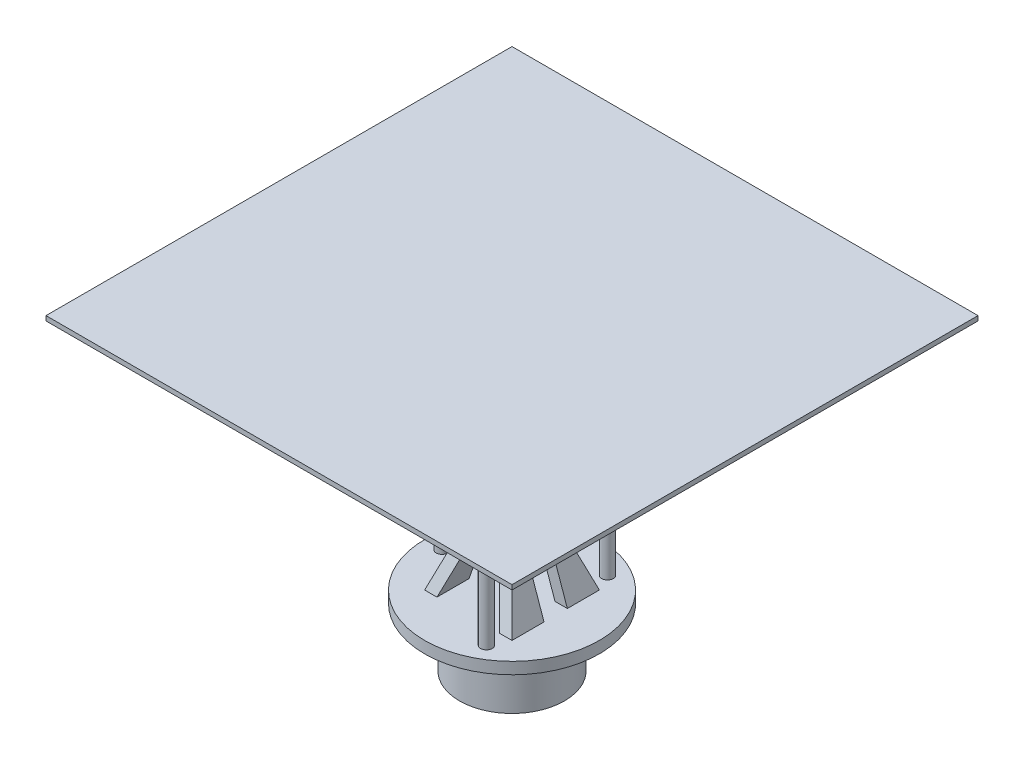
ISO-10303-21;
HEADER;
FILE_DESCRIPTION(('STEP AP214'),'2;1');
FILE_NAME('part.step','',(''),(''),'','','');
FILE_SCHEMA(('AUTOMOTIVE_DESIGN { 1 0 10303 214 1 1 1 1 }'));
ENDSEC;
DATA;
#1=APPLICATION_CONTEXT('core data for automotive mechanical design processes');
#2=APPLICATION_PROTOCOL_DEFINITION('international standard','automotive_design',2000,#1);
#3=PRODUCT_CONTEXT('',#1,'mechanical');
#4=PRODUCT('Part','Part','',(#3));
#5=PRODUCT_RELATED_PRODUCT_CATEGORY('part','',(#4));
#6=PRODUCT_DEFINITION_FORMATION('','',#4);
#7=PRODUCT_DEFINITION_CONTEXT('part definition',#1,'design');
#8=PRODUCT_DEFINITION('design','',#6,#7);
#9=PRODUCT_DEFINITION_SHAPE('','',#8);
#10=(LENGTH_UNIT() NAMED_UNIT(*) SI_UNIT(.MILLI.,.METRE.));
#11=(NAMED_UNIT(*) PLANE_ANGLE_UNIT() SI_UNIT($,.RADIAN.));
#12=(NAMED_UNIT(*) SI_UNIT($,.STERADIAN.) SOLID_ANGLE_UNIT());
#13=UNCERTAINTY_MEASURE_WITH_UNIT(LENGTH_MEASURE(1.E-05),#10,'distance_accuracy_value','');
#14=(GEOMETRIC_REPRESENTATION_CONTEXT(3) GLOBAL_UNCERTAINTY_ASSIGNED_CONTEXT((#13)) GLOBAL_UNIT_ASSIGNED_CONTEXT((#10,
#11,#12)) REPRESENTATION_CONTEXT('',''));
#15=CARTESIAN_POINT('',(0.,0.,0.));
#16=DIRECTION('',(0.,0.,1.));
#17=DIRECTION('',(1.,0.,0.));
#18=AXIS2_PLACEMENT_3D('',#15,#16,#17);
#19=CARTESIAN_POINT('',(103.,9.99999999999999,-10.));
#20=DIRECTION('',(0.,0.,1.));
#21=DIRECTION('',(1.,0.,0.));
#22=AXIS2_PLACEMENT_3D('',#19,#20,#21);
#23=PLANE('',#22);
#24=CARTESIAN_POINT('',(0.,55.,-10.));
#25=DIRECTION('',(0.,0.,1.));
#26=DIRECTION('',(1.,0.,0.));
#27=AXIS2_PLACEMENT_3D('',#24,#25,#26);
#28=CIRCLE('',#27,15.);
#29=CARTESIAN_POINT('',(-14.1421356237309,60.,-10.));
#30=VERTEX_POINT('',#29);
#31=CARTESIAN_POINT('',(-13.467179647447,48.3943151495556,-10.));
#32=VERTEX_POINT('',#31);
#33=EDGE_CURVE('E11',#30,#32,#28,.T.);
#34=ORIENTED_EDGE('',*,*,#33,.F.);
#35=DIRECTION('',(-1.,0.,0.));
#36=VECTOR('',#35,1.);
#37=CARTESIAN_POINT('',(103.,60.,-10.));
#38=LINE('',#37,#36);
#39=CARTESIAN_POINT('',(-20.,60.,-10.));
#40=VERTEX_POINT('',#39);
#41=EDGE_CURVE('E286',#30,#40,#38,.T.);
#42=ORIENTED_EDGE('',*,*,#41,.T.);
#43=DIRECTION('',(-0.330350424728106,-0.943858356366018,0.));
#44=VECTOR('',#43,1.);
#45=CARTESIAN_POINT('',(-20.,60.,-10.));
#46=LINE('',#45,#44);
#47=CARTESIAN_POINT('',(-37.5,9.99999999999999,-10.));
#48=VERTEX_POINT('',#47);
#49=EDGE_CURVE('E320',#40,#48,#46,.T.);
#50=ORIENTED_EDGE('',*,*,#49,.T.);
#51=DIRECTION('',(-1.,0.,0.));
#52=VECTOR('',#51,1.);
#53=CARTESIAN_POINT('',(103.,9.99999999999999,-10.));
#54=LINE('',#53,#52);
#55=CARTESIAN_POINT('',(-26.9051899497914,9.99999999999999,-10.));
#56=VERTEX_POINT('',#55);
#57=EDGE_CURVE('E289',#56,#48,#54,.T.);
#58=ORIENTED_EDGE('',*,*,#57,.F.);
#59=DIRECTION('',(0.330350424728106,0.943858356366017,0.));
#60=VECTOR('',#59,1.);
#61=CARTESIAN_POINT('',(-12.9051899497914,50.,-10.));
#62=LINE('',#61,#60);
#63=EDGE_CURVE('E309',#56,#32,#62,.T.);
#64=ORIENTED_EDGE('',*,*,#63,.T.);
#65=EDGE_LOOP('',(#34,#42,#50,#58,#64));
#66=FACE_BOUND('',#65,.T.);
#67=ADVANCED_FACE('F39',(#66),#23,.T.);
#68=CARTESIAN_POINT('',(103.,9.99999999999999,10.));
#69=DIRECTION('',(0.,0.,-1.));
#70=DIRECTION('',(-1.,0.,0.));
#71=AXIS2_PLACEMENT_3D('',#68,#69,#70);
#72=PLANE('',#71);
#73=CARTESIAN_POINT('',(0.,55.,10.));
#74=DIRECTION('',(0.,0.,-1.));
#75=DIRECTION('',(-1.,0.,0.));
#76=AXIS2_PLACEMENT_3D('',#73,#74,#75);
#77=CIRCLE('',#76,15.);
#78=CARTESIAN_POINT('',(14.1421356237309,60.,10.));
#79=VERTEX_POINT('',#78);
#80=CARTESIAN_POINT('',(13.467179647447,48.3943151495556,10.));
#81=VERTEX_POINT('',#80);
#82=EDGE_CURVE('E227',#79,#81,#77,.T.);
#83=ORIENTED_EDGE('',*,*,#82,.F.);
#84=DIRECTION('',(-1.,0.,0.));
#85=VECTOR('',#84,1.);
#86=CARTESIAN_POINT('',(103.,60.,10.));
#87=LINE('',#86,#85);
#88=CARTESIAN_POINT('',(20.,60.,9.99999999999999));
#89=VERTEX_POINT('',#88);
#90=EDGE_CURVE('E205',#89,#79,#87,.T.);
#91=ORIENTED_EDGE('',*,*,#90,.F.);
#92=DIRECTION('',(0.330350424728106,-0.943858356366018,0.));
#93=VECTOR('',#92,1.);
#94=CARTESIAN_POINT('',(20.,60.,9.99999999999999));
#95=LINE('',#94,#93);
#96=CARTESIAN_POINT('',(37.5,9.99999999999999,10.));
#97=VERTEX_POINT('',#96);
#98=EDGE_CURVE('E305',#89,#97,#95,.T.);
#99=ORIENTED_EDGE('',*,*,#98,.T.);
#100=DIRECTION('',(-1.,0.,0.));
#101=VECTOR('',#100,1.);
#102=CARTESIAN_POINT('',(103.,9.99999999999999,10.));
#103=LINE('',#102,#101);
#104=CARTESIAN_POINT('',(26.9051899497914,9.99999999999999,10.));
#105=VERTEX_POINT('',#104);
#106=EDGE_CURVE('E218',#97,#105,#103,.T.);
#107=ORIENTED_EDGE('',*,*,#106,.T.);
#108=DIRECTION('',(-0.330350424728106,0.943858356366018,0.));
#109=VECTOR('',#108,1.);
#110=CARTESIAN_POINT('',(12.9051899497914,50.,9.99999999999999));
#111=LINE('',#110,#109);
#112=EDGE_CURVE('E302',#105,#81,#111,.T.);
#113=ORIENTED_EDGE('',*,*,#112,.T.);
#114=EDGE_LOOP('',(#83,#91,#99,#107,#113));
#115=FACE_BOUND('',#114,.T.);
#116=ADVANCED_FACE('F472',(#115),#72,.T.);
#117=CARTESIAN_POINT('',(0.,60.,0.));
#118=DIRECTION('',(0.,1.,0.));
#119=DIRECTION('',(0.,0.,1.));
#120=AXIS2_PLACEMENT_3D('',#117,#118,#119);
#121=PLANE('',#120);
#122=DIRECTION('',(0.,0.,-1.));
#123=VECTOR('',#122,1.);
#124=CARTESIAN_POINT('',(-20.,60.,0.));
#125=LINE('',#124,#123);
#126=CARTESIAN_POINT('',(-20.,60.,-20.));
#127=VERTEX_POINT('',#126);
#128=EDGE_CURVE('E398',#40,#127,#125,.T.);
#129=ORIENTED_EDGE('',*,*,#128,.F.);
#130=ORIENTED_EDGE('',*,*,#41,.F.);
#131=CARTESIAN_POINT('',(14.1421356237309,60.,-10.));
#132=VERTEX_POINT('',#131);
#133=EDGE_CURVE('E290',#132,#30,#38,.T.);
#134=ORIENTED_EDGE('',*,*,#133,.F.);
#135=CARTESIAN_POINT('',(20.,60.,-10.));
#136=VERTEX_POINT('',#135);
#137=EDGE_CURVE('E287',#136,#132,#38,.T.);
#138=ORIENTED_EDGE('',*,*,#137,.F.);
#139=DIRECTION('',(0.,0.,1.));
#140=VECTOR('',#139,1.);
#141=CARTESIAN_POINT('',(20.,60.,0.));
#142=LINE('',#141,#140);
#143=CARTESIAN_POINT('',(20.,60.,-20.));
#144=VERTEX_POINT('',#143);
#145=EDGE_CURVE('E402',#144,#136,#142,.T.);
#146=ORIENTED_EDGE('',*,*,#145,.F.);
#147=DIRECTION('',(-1.,0.,0.));
#148=VECTOR('',#147,1.);
#149=CARTESIAN_POINT('',(103.,60.,-20.));
#150=LINE('',#149,#148);
#151=EDGE_CURVE('E322',#144,#127,#150,.T.);
#152=ORIENTED_EDGE('',*,*,#151,.T.);
#153=EDGE_LOOP('',(#129,#130,#134,#138,#146,#152));
#154=FACE_BOUND('',#153,.T.);
#155=ADVANCED_FACE('F479',(#154),#121,.T.);
#156=CARTESIAN_POINT('',(20.,60.,20.));
#157=VERTEX_POINT('',#156);
#158=EDGE_CURVE('E401',#89,#157,#142,.T.);
#159=ORIENTED_EDGE('',*,*,#158,.F.);
#160=ORIENTED_EDGE('',*,*,#90,.T.);
#161=CARTESIAN_POINT('',(-14.1421356237309,60.,10.));
#162=VERTEX_POINT('',#161);
#163=EDGE_CURVE('E198',#79,#162,#87,.T.);
#164=ORIENTED_EDGE('',*,*,#163,.T.);
#165=CARTESIAN_POINT('',(-20.,60.,10.));
#166=VERTEX_POINT('',#165);
#167=EDGE_CURVE('E203',#162,#166,#87,.T.);
#168=ORIENTED_EDGE('',*,*,#167,.T.);
#169=CARTESIAN_POINT('',(-20.,60.,20.));
#170=VERTEX_POINT('',#169);
#171=EDGE_CURVE('E399',#170,#166,#125,.T.);
#172=ORIENTED_EDGE('',*,*,#171,.F.);
#173=DIRECTION('',(-1.,0.,0.));
#174=VECTOR('',#173,1.);
#175=CARTESIAN_POINT('',(103.,60.,20.));
#176=LINE('',#175,#174);
#177=EDGE_CURVE('E325',#157,#170,#176,.T.);
#178=ORIENTED_EDGE('',*,*,#177,.F.);
#179=EDGE_LOOP('',(#159,#160,#164,#168,#172,#178));
#180=FACE_BOUND('',#179,.T.);
#181=ADVANCED_FACE('F201',(#180),#121,.T.);
#182=CARTESIAN_POINT('',(-20.,60.,-65.5));
#183=DIRECTION('',(0.943858356366017,-0.330350424728106,0.));
#184=DIRECTION('',(0.330350424728106,0.943858356366018,0.));
#185=AXIS2_PLACEMENT_3D('',#182,#183,#184);
#186=PLANE('',#185);
#187=ORIENTED_EDGE('',*,*,#49,.F.);
#188=ORIENTED_EDGE('',*,*,#128,.T.);
#189=DIRECTION('',(0.313677500463755,0.896221429896442,0.313677500463755));
#190=VECTOR('',#189,1.);
#191=CARTESIAN_POINT('',(-24.4769076305221,47.2088353413655,-24.4769076305221));
#192=LINE('',#191,#190);
#193=CARTESIAN_POINT('',(-37.5,10.,-37.5));
#194=VERTEX_POINT('',#193);
#195=EDGE_CURVE('E334',#194,#127,#192,.T.);
#196=ORIENTED_EDGE('',*,*,#195,.F.);
#197=DIRECTION('',(0.,0.,1.));
#198=VECTOR('',#197,1.);
#199=CARTESIAN_POINT('',(-37.5,10.,37.5));
#200=LINE('',#199,#198);
#201=EDGE_CURVE('E366',#194,#48,#200,.T.);
#202=ORIENTED_EDGE('',*,*,#201,.T.);
#203=EDGE_LOOP('',(#187,#188,#196,#202));
#204=FACE_BOUND('',#203,.T.);
#205=ADVANCED_FACE('F518',(#204),#186,.F.);
#206=DIRECTION('',(0.330350424728106,0.943858356366018,0.));
#207=VECTOR('',#206,1.);
#208=CARTESIAN_POINT('',(-20.,60.,9.99999999999999));
#209=LINE('',#208,#207);
#210=CARTESIAN_POINT('',(-37.5,9.99999999999999,10.));
#211=VERTEX_POINT('',#210);
#212=EDGE_CURVE('E216',#211,#166,#209,.T.);
#213=ORIENTED_EDGE('',*,*,#212,.F.);
#214=CARTESIAN_POINT('',(-37.5,9.99999999999999,37.5));
#215=VERTEX_POINT('',#214);
#216=EDGE_CURVE('E353',#211,#215,#200,.T.);
#217=ORIENTED_EDGE('',*,*,#216,.T.);
#218=DIRECTION('',(-0.313677500463755,-0.896221429896442,0.313677500463755));
#219=VECTOR('',#218,1.);
#220=CARTESIAN_POINT('',(-11.5873493975904,84.0361445783133,11.5873493975904));
#221=LINE('',#220,#219);
#222=EDGE_CURVE('E346',#170,#215,#221,.T.);
#223=ORIENTED_EDGE('',*,*,#222,.F.);
#224=ORIENTED_EDGE('',*,*,#171,.T.);
#225=EDGE_LOOP('',(#213,#217,#223,#224));
#226=FACE_BOUND('',#225,.T.);
#227=ADVANCED_FACE('F516',(#226),#186,.F.);
#228=CARTESIAN_POINT('',(20.,60.,-65.5));
#229=DIRECTION('',(-0.943858356366017,-0.330350424728106,0.));
#230=DIRECTION('',(0.330350424728106,-0.943858356366018,0.));
#231=AXIS2_PLACEMENT_3D('',#228,#229,#230);
#232=PLANE('',#231);
#233=DIRECTION('',(-0.330350424728106,0.943858356366018,0.));
#234=VECTOR('',#233,1.);
#235=CARTESIAN_POINT('',(20.,60.,-10.));
#236=LINE('',#235,#234);
#237=CARTESIAN_POINT('',(37.5,9.99999999999999,-10.));
#238=VERTEX_POINT('',#237);
#239=EDGE_CURVE('E318',#238,#136,#236,.T.);
#240=ORIENTED_EDGE('',*,*,#239,.F.);
#241=DIRECTION('',(0.,0.,-1.));
#242=VECTOR('',#241,1.);
#243=CARTESIAN_POINT('',(37.5,10.,37.5));
#244=LINE('',#243,#242);
#245=CARTESIAN_POINT('',(37.5,10.,-37.5));
#246=VERTEX_POINT('',#245);
#247=EDGE_CURVE('E373',#238,#246,#244,.T.);
#248=ORIENTED_EDGE('',*,*,#247,.T.);
#249=DIRECTION('',(0.313677500463755,-0.896221429896442,-0.313677500463755));
#250=VECTOR('',#249,1.);
#251=CARTESIAN_POINT('',(24.4769076305221,47.2088353413655,-24.4769076305221));
#252=LINE('',#251,#250);
#253=EDGE_CURVE('E331',#144,#246,#252,.T.);
#254=ORIENTED_EDGE('',*,*,#253,.F.);
#255=ORIENTED_EDGE('',*,*,#145,.T.);
#256=EDGE_LOOP('',(#240,#248,#254,#255));
#257=FACE_BOUND('',#256,.T.);
#258=ADVANCED_FACE('F513',(#257),#232,.F.);
#259=ORIENTED_EDGE('',*,*,#98,.F.);
#260=ORIENTED_EDGE('',*,*,#158,.T.);
#261=DIRECTION('',(-0.313677500463755,0.896221429896442,-0.313677500463755));
#262=VECTOR('',#261,1.);
#263=CARTESIAN_POINT('',(11.5873493975904,84.0361445783133,11.5873493975904));
#264=LINE('',#263,#262);
#265=CARTESIAN_POINT('',(37.5,9.99999999999998,37.5));
#266=VERTEX_POINT('',#265);
#267=EDGE_CURVE('E343',#266,#157,#264,.T.);
#268=ORIENTED_EDGE('',*,*,#267,.F.);
#269=EDGE_CURVE('E374',#266,#97,#244,.T.);
#270=ORIENTED_EDGE('',*,*,#269,.T.);
#271=EDGE_LOOP('',(#259,#260,#268,#270));
#272=FACE_BOUND('',#271,.T.);
#273=ADVANCED_FACE('F511',(#272),#232,.F.);
#274=CARTESIAN_POINT('',(12.9051899497914,50.,-65.5));
#275=DIRECTION('',(0.,1.,0.));
#276=DIRECTION('',(0.,0.,1.));
#277=AXIS2_PLACEMENT_3D('',#274,#275,#276);
#278=PLANE('',#277);
#279=DIRECTION('',(1.,0.,0.));
#280=VECTOR('',#279,1.);
#281=CARTESIAN_POINT('',(12.9051899497914,50.,-10.));
#282=LINE('',#281,#280);
#283=CARTESIAN_POINT('',(-12.9051899497914,50.,-10.));
#284=VERTEX_POINT('',#283);
#285=CARTESIAN_POINT('',(12.9051899497914,50.,-10.));
#286=VERTEX_POINT('',#285);
#287=EDGE_CURVE('E311',#284,#286,#282,.T.);
#288=ORIENTED_EDGE('',*,*,#287,.F.);
#289=DIRECTION('',(0.,0.,1.));
#290=VECTOR('',#289,1.);
#291=CARTESIAN_POINT('',(-12.9051899497914,50.,-65.5));
#292=LINE('',#291,#290);
#293=CARTESIAN_POINT('',(-12.9051899497914,50.,-23.5));
#294=VERTEX_POINT('',#293);
#295=EDGE_CURVE('E363',#294,#284,#292,.T.);
#296=ORIENTED_EDGE('',*,*,#295,.F.);
#297=DIRECTION('',(-1.,0.,0.));
#298=VECTOR('',#297,1.);
#299=CARTESIAN_POINT('',(12.9051899497914,50.,-23.5));
#300=LINE('',#299,#298);
#301=CARTESIAN_POINT('',(12.9051899497914,50.,-23.5));
#302=VERTEX_POINT('',#301);
#303=EDGE_CURVE('E327',#302,#294,#300,.T.);
#304=ORIENTED_EDGE('',*,*,#303,.F.);
#305=DIRECTION('',(0.,0.,1.));
#306=VECTOR('',#305,1.);
#307=CARTESIAN_POINT('',(12.9051899497914,50.,-65.5));
#308=LINE('',#307,#306);
#309=EDGE_CURVE('E350',#302,#286,#308,.T.);
#310=ORIENTED_EDGE('',*,*,#309,.T.);
#311=EDGE_LOOP('',(#288,#296,#304,#310));
#312=FACE_BOUND('',#311,.T.);
#313=ADVANCED_FACE('F508',(#312),#278,.F.);
#314=DIRECTION('',(-1.,0.,0.));
#315=VECTOR('',#314,1.);
#316=CARTESIAN_POINT('',(12.9051899497914,50.,9.99999999999999));
#317=LINE('',#316,#315);
#318=CARTESIAN_POINT('',(12.9051899497914,50.,9.99999999999999));
#319=VERTEX_POINT('',#318);
#320=CARTESIAN_POINT('',(-12.9051899497914,50.,9.99999999999999));
#321=VERTEX_POINT('',#320);
#322=EDGE_CURVE('E297',#319,#321,#317,.T.);
#323=ORIENTED_EDGE('',*,*,#322,.F.);
#324=CARTESIAN_POINT('',(12.9051899497914,50.,23.5));
#325=VERTEX_POINT('',#324);
#326=EDGE_CURVE('E354',#319,#325,#308,.T.);
#327=ORIENTED_EDGE('',*,*,#326,.T.);
#328=DIRECTION('',(1.,0.,0.));
#329=VECTOR('',#328,1.);
#330=CARTESIAN_POINT('',(12.9051899497914,50.,23.5));
#331=LINE('',#330,#329);
#332=CARTESIAN_POINT('',(-12.9051899497914,50.,23.5));
#333=VERTEX_POINT('',#332);
#334=EDGE_CURVE('E337',#333,#325,#331,.T.);
#335=ORIENTED_EDGE('',*,*,#334,.F.);
#336=EDGE_CURVE('E349',#321,#333,#292,.T.);
#337=ORIENTED_EDGE('',*,*,#336,.F.);
#338=EDGE_LOOP('',(#323,#327,#335,#337));
#339=FACE_BOUND('',#338,.T.);
#340=ADVANCED_FACE('F502',(#339),#278,.F.);
#341=CARTESIAN_POINT('',(12.9051899497914,50.,-65.5));
#342=DIRECTION('',(0.943858356366017,0.330350424728106,0.));
#343=DIRECTION('',(-0.330350424728106,0.943858356366018,0.));
#344=AXIS2_PLACEMENT_3D('',#341,#342,#343);
#345=PLANE('',#344);
#346=DIRECTION('',(0.330350424728106,-0.943858356366018,0.));
#347=VECTOR('',#346,1.);
#348=CARTESIAN_POINT('',(12.9051899497914,50.,-10.));
#349=LINE('',#348,#347);
#350=CARTESIAN_POINT('',(13.467179647447,48.3943151495556,-10.));
#351=VERTEX_POINT('',#350);
#352=EDGE_CURVE('E315',#286,#351,#349,.T.);
#353=ORIENTED_EDGE('',*,*,#352,.F.);
#354=ORIENTED_EDGE('',*,*,#309,.F.);
#355=DIRECTION('',(-0.313677500463755,0.896221429896442,0.313677500463755));
#356=VECTOR('',#355,1.);
#357=CARTESIAN_POINT('',(17.0377200702734,38.1927710843373,-27.6325301204819));
#358=LINE('',#357,#356);
#359=CARTESIAN_POINT('',(26.9051899497914,10.,-37.5));
#360=VERTEX_POINT('',#359);
#361=EDGE_CURVE('E329',#360,#302,#358,.T.);
#362=ORIENTED_EDGE('',*,*,#361,.F.);
#363=DIRECTION('',(0.,0.,1.));
#364=VECTOR('',#363,1.);
#365=CARTESIAN_POINT('',(26.9051899497914,10.,-65.5));
#366=LINE('',#365,#364);
#367=CARTESIAN_POINT('',(26.9051899497914,9.99999999999999,-10.));
#368=VERTEX_POINT('',#367);
#369=EDGE_CURVE('E355',#360,#368,#366,.T.);
#370=ORIENTED_EDGE('',*,*,#369,.T.);
#371=EDGE_CURVE('E314',#351,#368,#349,.T.);
#372=ORIENTED_EDGE('',*,*,#371,.F.);
#373=EDGE_LOOP('',(#353,#354,#362,#370,#372));
#374=FACE_BOUND('',#373,.T.);
#375=ADVANCED_FACE('F498',(#374),#345,.F.);
#376=ORIENTED_EDGE('',*,*,#112,.F.);
#377=CARTESIAN_POINT('',(26.9051899497915,9.99999999999998,37.5));
#378=VERTEX_POINT('',#377);
#379=EDGE_CURVE('E358',#105,#378,#366,.T.);
#380=ORIENTED_EDGE('',*,*,#379,.T.);
#381=DIRECTION('',(0.313677500463755,-0.896221429896442,0.313677500463755));
#382=VECTOR('',#381,1.);
#383=CARTESIAN_POINT('',(4.14816183734165,75.0200803212851,14.7429718875502));
#384=LINE('',#383,#382);
#385=EDGE_CURVE('E340',#325,#378,#384,.T.);
#386=ORIENTED_EDGE('',*,*,#385,.F.);
#387=ORIENTED_EDGE('',*,*,#326,.F.);
#388=EDGE_CURVE('E301',#81,#319,#111,.T.);
#389=ORIENTED_EDGE('',*,*,#388,.F.);
#390=EDGE_LOOP('',(#376,#380,#386,#387,#389));
#391=FACE_BOUND('',#390,.T.);
#392=ADVANCED_FACE('F501',(#391),#345,.F.);
#393=CARTESIAN_POINT('',(-12.9051899497914,50.,-65.5));
#394=DIRECTION('',(-0.943858356366017,0.330350424728106,0.));
#395=DIRECTION('',(-0.330350424728106,-0.943858356366017,0.));
#396=AXIS2_PLACEMENT_3D('',#393,#394,#395);
#397=PLANE('',#396);
#398=ORIENTED_EDGE('',*,*,#63,.F.);
#399=DIRECTION('',(0.,0.,1.));
#400=VECTOR('',#399,1.);
#401=CARTESIAN_POINT('',(-26.9051899497914,10.,-65.5));
#402=LINE('',#401,#400);
#403=CARTESIAN_POINT('',(-26.9051899497914,10.,-37.5));
#404=VERTEX_POINT('',#403);
#405=EDGE_CURVE('E359',#404,#56,#402,.T.);
#406=ORIENTED_EDGE('',*,*,#405,.F.);
#407=DIRECTION('',(-0.313677500463755,-0.896221429896442,-0.313677500463755));
#408=VECTOR('',#407,1.);
#409=CARTESIAN_POINT('',(-17.0377200702734,38.1927710843373,-27.6325301204819));
#410=LINE('',#409,#408);
#411=EDGE_CURVE('E405',#294,#404,#410,.T.);
#412=ORIENTED_EDGE('',*,*,#411,.F.);
#413=ORIENTED_EDGE('',*,*,#295,.T.);
#414=EDGE_CURVE('E308',#32,#284,#62,.T.);
#415=ORIENTED_EDGE('',*,*,#414,.F.);
#416=EDGE_LOOP('',(#398,#406,#412,#413,#415));
#417=FACE_BOUND('',#416,.T.);
#418=ADVANCED_FACE('F504',(#417),#397,.F.);
#419=DIRECTION('',(-0.330350424728106,-0.943858356366017,0.));
#420=VECTOR('',#419,1.);
#421=CARTESIAN_POINT('',(-12.9051899497914,50.,9.99999999999999));
#422=LINE('',#421,#420);
#423=CARTESIAN_POINT('',(-13.467179647447,48.3943151495556,10.));
#424=VERTEX_POINT('',#423);
#425=EDGE_CURVE('E294',#321,#424,#422,.T.);
#426=ORIENTED_EDGE('',*,*,#425,.F.);
#427=ORIENTED_EDGE('',*,*,#336,.T.);
#428=DIRECTION('',(0.313677500463755,0.896221429896442,-0.313677500463755));
#429=VECTOR('',#428,1.);
#430=CARTESIAN_POINT('',(-4.14816183734164,75.0200803212851,14.7429718875502));
#431=LINE('',#430,#429);
#432=CARTESIAN_POINT('',(-26.9051899497914,10.,37.5));
#433=VERTEX_POINT('',#432);
#434=EDGE_CURVE('E407',#433,#333,#431,.T.);
#435=ORIENTED_EDGE('',*,*,#434,.F.);
#436=CARTESIAN_POINT('',(-26.9051899497914,9.99999999999999,10.));
#437=VERTEX_POINT('',#436);
#438=EDGE_CURVE('E362',#437,#433,#402,.T.);
#439=ORIENTED_EDGE('',*,*,#438,.F.);
#440=EDGE_CURVE('E298',#424,#437,#422,.T.);
#441=ORIENTED_EDGE('',*,*,#440,.F.);
#442=EDGE_LOOP('',(#426,#427,#435,#439,#441));
#443=FACE_BOUND('',#442,.T.);
#444=ADVANCED_FACE('F452',(#443),#397,.F.);
#445=CARTESIAN_POINT('',(0.,10.,0.));
#446=DIRECTION('',(0.,-1.,0.));
#447=DIRECTION('',(0.,0.,-1.));
#448=AXIS2_PLACEMENT_3D('',#445,#446,#447);
#449=CYLINDRICAL_SURFACE('',#448,75.);
#450=CARTESIAN_POINT('',(0.,10.,0.));
#451=DIRECTION('',(0.,1.,0.));
#452=DIRECTION('',(0.,0.,1.));
#453=AXIS2_PLACEMENT_3D('',#450,#451,#452);
#454=CIRCLE('',#453,75.);
#455=CARTESIAN_POINT('',(0.,10.,75.));
#456=VERTEX_POINT('',#455);
#457=EDGE_CURVE('E390',#456,#456,#454,.T.);
#458=ORIENTED_EDGE('',*,*,#457,.F.);
#459=EDGE_LOOP('',(#458));
#460=FACE_BOUND('',#459,.T.);
#461=CARTESIAN_POINT('',(0.,0.,0.));
#462=DIRECTION('',(0.,1.,0.));
#463=DIRECTION('',(0.,0.,1.));
#464=AXIS2_PLACEMENT_3D('',#461,#462,#463);
#465=CIRCLE('',#464,75.);
#466=CARTESIAN_POINT('',(0.,0.,75.));
#467=VERTEX_POINT('',#466);
#468=EDGE_CURVE('E389',#467,#467,#465,.T.);
#469=ORIENTED_EDGE('',*,*,#468,.T.);
#470=EDGE_LOOP('',(#469));
#471=FACE_BOUND('',#470,.T.);
#472=ADVANCED_FACE('F41',(#460,#471),#449,.T.);
#473=CARTESIAN_POINT('',(0.,10.,0.));
#474=DIRECTION('',(0.,1.,0.));
#475=DIRECTION('',(0.,0.,1.));
#476=AXIS2_PLACEMENT_3D('',#473,#474,#475);
#477=PLANE('',#476);
#478=CARTESIAN_POINT('',(29.9999999999995,10.,51.9615242270666));
#479=DIRECTION('',(0.,1.,0.));
#480=DIRECTION('',(0.,0.,1.));
#481=AXIS2_PLACEMENT_3D('',#478,#479,#480);
#482=CIRCLE('',#481,5.);
#483=CARTESIAN_POINT('',(29.9999999999995,10.,56.9615242270666));
#484=VERTEX_POINT('',#483);
#485=EDGE_CURVE('E228',#484,#484,#482,.T.);
#486=ORIENTED_EDGE('',*,*,#485,.F.);
#487=EDGE_LOOP('',(#486));
#488=FACE_BOUND('',#487,.T.);
#489=CARTESIAN_POINT('',(30.0000000000002,10.,-51.9615242270662));
#490=DIRECTION('',(0.,1.,0.));
#491=DIRECTION('',(0.,0.,1.));
#492=AXIS2_PLACEMENT_3D('',#489,#490,#491);
#493=CIRCLE('',#492,5.);
#494=CARTESIAN_POINT('',(30.0000000000002,10.,-46.9615242270662));
#495=VERTEX_POINT('',#494);
#496=EDGE_CURVE('E415',#495,#495,#493,.T.);
#497=ORIENTED_EDGE('',*,*,#496,.F.);
#498=EDGE_LOOP('',(#497));
#499=FACE_BOUND('',#498,.T.);
#500=CARTESIAN_POINT('',(-60.,10.,0.));
#501=DIRECTION('',(0.,1.,0.));
#502=DIRECTION('',(0.,0.,1.));
#503=AXIS2_PLACEMENT_3D('',#500,#501,#502);
#504=CIRCLE('',#503,5.);
#505=CARTESIAN_POINT('',(-60.,10.,5.));
#506=VERTEX_POINT('',#505);
#507=EDGE_CURVE('E410',#506,#506,#504,.T.);
#508=ORIENTED_EDGE('',*,*,#507,.F.);
#509=EDGE_LOOP('',(#508));
#510=FACE_BOUND('',#509,.T.);
#511=CARTESIAN_POINT('',(0.,10.,0.));
#512=DIRECTION('',(0.,1.,0.));
#513=DIRECTION('',(0.,0.,1.));
#514=AXIS2_PLACEMENT_3D('',#511,#512,#513);
#515=CIRCLE('',#514,5.);
#516=CARTESIAN_POINT('',(0.,10.,5.));
#517=VERTEX_POINT('',#516);
#518=EDGE_CURVE('E280',#517,#517,#515,.T.);
#519=ORIENTED_EDGE('',*,*,#518,.F.);
#520=EDGE_LOOP('',(#519));
#521=FACE_BOUND('',#520,.T.);
#522=ORIENTED_EDGE('',*,*,#216,.F.);
#523=EDGE_CURVE('E284',#437,#211,#103,.T.);
#524=ORIENTED_EDGE('',*,*,#523,.F.);
#525=ORIENTED_EDGE('',*,*,#438,.T.);
#526=DIRECTION('',(1.,0.,0.));
#527=VECTOR('',#526,1.);
#528=CARTESIAN_POINT('',(37.5,10.,37.5));
#529=LINE('',#528,#527);
#530=EDGE_CURVE('E370',#215,#433,#529,.T.);
#531=ORIENTED_EDGE('',*,*,#530,.F.);
#532=EDGE_LOOP('',(#522,#524,#525,#531));
#533=FACE_BOUND('',#532,.T.);
#534=ORIENTED_EDGE('',*,*,#247,.F.);
#535=EDGE_CURVE('E293',#238,#368,#54,.T.);
#536=ORIENTED_EDGE('',*,*,#535,.T.);
#537=ORIENTED_EDGE('',*,*,#369,.F.);
#538=DIRECTION('',(-1.,0.,0.));
#539=VECTOR('',#538,1.);
#540=CARTESIAN_POINT('',(37.5,10.,-37.5));
#541=LINE('',#540,#539);
#542=EDGE_CURVE('E378',#246,#360,#541,.T.);
#543=ORIENTED_EDGE('',*,*,#542,.F.);
#544=EDGE_LOOP('',(#534,#536,#537,#543));
#545=FACE_BOUND('',#544,.T.);
#546=ORIENTED_EDGE('',*,*,#57,.T.);
#547=ORIENTED_EDGE('',*,*,#201,.F.);
#548=EDGE_CURVE('E377',#404,#194,#541,.T.);
#549=ORIENTED_EDGE('',*,*,#548,.F.);
#550=ORIENTED_EDGE('',*,*,#405,.T.);
#551=EDGE_LOOP('',(#546,#547,#549,#550));
#552=FACE_BOUND('',#551,.T.);
#553=ORIENTED_EDGE('',*,*,#379,.F.);
#554=ORIENTED_EDGE('',*,*,#106,.F.);
#555=ORIENTED_EDGE('',*,*,#269,.F.);
#556=EDGE_CURVE('E369',#378,#266,#529,.T.);
#557=ORIENTED_EDGE('',*,*,#556,.F.);
#558=EDGE_LOOP('',(#553,#554,#555,#557));
#559=FACE_BOUND('',#558,.T.);
#560=ORIENTED_EDGE('',*,*,#457,.T.);
#561=EDGE_LOOP('',(#560));
#562=FACE_BOUND('',#561,.T.);
#563=ADVANCED_FACE('F423',(#488,#499,#510,#521,#533,#545,#552,#559,#562),#477,.T.);
#564=CARTESIAN_POINT('',(0.,0.,0.));
#565=DIRECTION('',(0.,1.,0.));
#566=DIRECTION('',(0.,0.,1.));
#567=AXIS2_PLACEMENT_3D('',#564,#565,#566);
#568=PLANE('',#567);
#569=CARTESIAN_POINT('',(0.,0.,0.));
#570=DIRECTION('',(0.,1.,0.));
#571=DIRECTION('',(0.,0.,1.));
#572=AXIS2_PLACEMENT_3D('',#569,#570,#571);
#573=CIRCLE('',#572,45.);
#574=CARTESIAN_POINT('',(0.,0.,45.));
#575=VERTEX_POINT('',#574);
#576=EDGE_CURVE('E393',#575,#575,#573,.F.);
#577=ORIENTED_EDGE('',*,*,#576,.F.);
#578=EDGE_LOOP('',(#577));
#579=FACE_BOUND('',#578,.T.);
#580=ORIENTED_EDGE('',*,*,#468,.F.);
#581=EDGE_LOOP('',(#580));
#582=FACE_BOUND('',#581,.T.);
#583=ADVANCED_FACE('F426',(#579,#582),#568,.F.);
#584=CARTESIAN_POINT('',(0.,-50.,0.));
#585=DIRECTION('',(0.,-1.,0.));
#586=DIRECTION('',(0.,0.,-1.));
#587=AXIS2_PLACEMENT_3D('',#584,#585,#586);
#588=PLANE('',#587);
#589=CARTESIAN_POINT('',(0.,-50.,0.));
#590=DIRECTION('',(0.,-1.,0.));
#591=DIRECTION('',(0.,0.,-1.));
#592=AXIS2_PLACEMENT_3D('',#589,#590,#591);
#593=CIRCLE('',#592,45.);
#594=CARTESIAN_POINT('',(0.,-50.,-45.));
#595=VERTEX_POINT('',#594);
#596=EDGE_CURVE('E384',#595,#595,#593,.T.);
#597=ORIENTED_EDGE('',*,*,#596,.T.);
#598=EDGE_LOOP('',(#597));
#599=FACE_BOUND('',#598,.T.);
#600=CARTESIAN_POINT('',(0.,-50.,0.));
#601=DIRECTION('',(0.,-1.,0.));
#602=DIRECTION('',(0.,0.,-1.));
#603=AXIS2_PLACEMENT_3D('',#600,#601,#602);
#604=CIRCLE('',#603,40.);
#605=CARTESIAN_POINT('',(0.,-50.,-40.));
#606=VERTEX_POINT('',#605);
#607=EDGE_CURVE('E381',#606,#606,#604,.T.);
#608=ORIENTED_EDGE('',*,*,#607,.F.);
#609=EDGE_LOOP('',(#608));
#610=FACE_BOUND('',#609,.T.);
#611=ADVANCED_FACE('F456',(#599,#610),#588,.T.);
#612=CARTESIAN_POINT('',(0.,-50.,0.));
#613=DIRECTION('',(0.,1.,0.));
#614=DIRECTION('',(0.,0.,1.));
#615=AXIS2_PLACEMENT_3D('',#612,#613,#614);
#616=CYLINDRICAL_SURFACE('',#615,45.);
#617=ORIENTED_EDGE('',*,*,#596,.F.);
#618=EDGE_LOOP('',(#617));
#619=FACE_BOUND('',#618,.T.);
#620=ORIENTED_EDGE('',*,*,#576,.T.);
#621=EDGE_LOOP('',(#620));
#622=FACE_BOUND('',#621,.T.);
#623=ADVANCED_FACE('F463',(#619,#622),#616,.T.);
#624=CARTESIAN_POINT('',(0.,-50.,0.));
#625=DIRECTION('',(0.,1.,0.));
#626=DIRECTION('',(0.,0.,1.));
#627=AXIS2_PLACEMENT_3D('',#624,#625,#626);
#628=CYLINDRICAL_SURFACE('',#627,40.);
#629=ORIENTED_EDGE('',*,*,#607,.T.);
#630=EDGE_LOOP('',(#629));
#631=FACE_BOUND('',#630,.T.);
#632=CARTESIAN_POINT('',(0.,0.,0.));
#633=DIRECTION('',(0.,-1.,0.));
#634=DIRECTION('',(0.,0.,-1.));
#635=AXIS2_PLACEMENT_3D('',#632,#633,#634);
#636=CIRCLE('',#635,40.);
#637=CARTESIAN_POINT('',(0.,0.,-40.));
#638=VERTEX_POINT('',#637);
#639=EDGE_CURVE('E380',#638,#638,#636,.T.);
#640=ORIENTED_EDGE('',*,*,#639,.F.);
#641=EDGE_LOOP('',(#640));
#642=FACE_BOUND('',#641,.T.);
#643=ADVANCED_FACE('F469',(#631,#642),#628,.F.);
#644=CARTESIAN_POINT('',(0.,0.,0.));
#645=DIRECTION('',(0.,1.,0.));
#646=DIRECTION('',(0.,0.,1.));
#647=AXIS2_PLACEMENT_3D('',#644,#645,#646);
#648=CIRCLE('',#647,5.);
#649=CARTESIAN_POINT('',(0.,0.,5.));
#650=VERTEX_POINT('',#649);
#651=EDGE_CURVE('E283',#650,#650,#648,.T.);
#652=ORIENTED_EDGE('',*,*,#651,.T.);
#653=EDGE_LOOP('',(#652));
#654=FACE_BOUND('',#653,.T.);
#655=ORIENTED_EDGE('',*,*,#639,.T.);
#656=EDGE_LOOP('',(#655));
#657=FACE_BOUND('',#656,.T.);
#658=ADVANCED_FACE('F458',(#654,#657),#568,.F.);
#659=CARTESIAN_POINT('',(103.,60.,-20.));
#660=DIRECTION('',(0.,0.330350424728106,-0.943858356366017));
#661=DIRECTION('',(0.,0.943858356366017,0.330350424728106));
#662=AXIS2_PLACEMENT_3D('',#659,#660,#661);
#663=PLANE('',#662);
#664=ORIENTED_EDGE('',*,*,#195,.T.);
#665=ORIENTED_EDGE('',*,*,#151,.F.);
#666=ORIENTED_EDGE('',*,*,#253,.T.);
#667=ORIENTED_EDGE('',*,*,#542,.T.);
#668=ORIENTED_EDGE('',*,*,#361,.T.);
#669=ORIENTED_EDGE('',*,*,#303,.T.);
#670=ORIENTED_EDGE('',*,*,#411,.T.);
#671=ORIENTED_EDGE('',*,*,#548,.T.);
#672=EDGE_LOOP('',(#664,#665,#666,#667,#668,#669,#670,#671));
#673=FACE_BOUND('',#672,.T.);
#674=ADVANCED_FACE('F468',(#673),#663,.T.);
#675=CARTESIAN_POINT('',(103.,60.,20.));
#676=DIRECTION('',(0.,0.330350424728106,0.943858356366017));
#677=DIRECTION('',(0.,-0.943858356366018,0.330350424728106));
#678=AXIS2_PLACEMENT_3D('',#675,#676,#677);
#679=PLANE('',#678);
#680=ORIENTED_EDGE('',*,*,#222,.T.);
#681=ORIENTED_EDGE('',*,*,#530,.T.);
#682=ORIENTED_EDGE('',*,*,#434,.T.);
#683=ORIENTED_EDGE('',*,*,#334,.T.);
#684=ORIENTED_EDGE('',*,*,#385,.T.);
#685=ORIENTED_EDGE('',*,*,#556,.T.);
#686=ORIENTED_EDGE('',*,*,#267,.T.);
#687=ORIENTED_EDGE('',*,*,#177,.T.);
#688=EDGE_LOOP('',(#680,#681,#682,#683,#684,#685,#686,#687));
#689=FACE_BOUND('',#688,.T.);
#690=ADVANCED_FACE('F484',(#689),#679,.T.);
#691=EDGE_CURVE('E43',#351,#132,#28,.T.);
#692=ORIENTED_EDGE('',*,*,#691,.F.);
#693=ORIENTED_EDGE('',*,*,#371,.T.);
#694=ORIENTED_EDGE('',*,*,#535,.F.);
#695=ORIENTED_EDGE('',*,*,#239,.T.);
#696=ORIENTED_EDGE('',*,*,#137,.T.);
#697=EDGE_LOOP('',(#692,#693,#694,#695,#696));
#698=FACE_BOUND('',#697,.T.);
#699=ADVANCED_FACE('F474',(#698),#23,.T.);
#700=EDGE_CURVE('E213',#424,#162,#77,.T.);
#701=ORIENTED_EDGE('',*,*,#700,.F.);
#702=ORIENTED_EDGE('',*,*,#440,.T.);
#703=ORIENTED_EDGE('',*,*,#523,.T.);
#704=ORIENTED_EDGE('',*,*,#212,.T.);
#705=ORIENTED_EDGE('',*,*,#167,.F.);
#706=EDGE_LOOP('',(#701,#702,#703,#704,#705));
#707=FACE_BOUND('',#706,.T.);
#708=ADVANCED_FACE('F212',(#707),#72,.T.);
#709=CARTESIAN_POINT('',(0.,-93.,0.));
#710=DIRECTION('',(0.,1.,0.));
#711=DIRECTION('',(0.,0.,1.));
#712=AXIS2_PLACEMENT_3D('',#709,#710,#711);
#713=CYLINDRICAL_SURFACE('',#712,5.);
#714=ORIENTED_EDGE('',*,*,#518,.T.);
#715=EDGE_LOOP('',(#714));
#716=FACE_BOUND('',#715,.T.);
#717=ORIENTED_EDGE('',*,*,#651,.F.);
#718=EDGE_LOOP('',(#717));
#719=FACE_BOUND('',#718,.T.);
#720=ADVANCED_FACE('F489',(#716,#719),#713,.F.);
#721=CARTESIAN_POINT('',(-60.,10.,0.));
#722=DIRECTION('',(0.,1.,0.));
#723=DIRECTION('',(0.,0.,1.));
#724=AXIS2_PLACEMENT_3D('',#721,#722,#723);
#725=CYLINDRICAL_SURFACE('',#724,5.);
#726=CARTESIAN_POINT('',(-60.,210.,0.));
#727=DIRECTION('',(0.,1.,0.));
#728=DIRECTION('',(0.,0.,1.));
#729=AXIS2_PLACEMENT_3D('',#726,#727,#728);
#730=CIRCLE('',#729,5.);
#731=CARTESIAN_POINT('',(-60.,210.,5.));
#732=VERTEX_POINT('',#731);
#733=EDGE_CURVE('E277',#732,#732,#730,.T.);
#734=ORIENTED_EDGE('',*,*,#733,.F.);
#735=EDGE_LOOP('',(#734));
#736=FACE_BOUND('',#735,.T.);
#737=ORIENTED_EDGE('',*,*,#507,.T.);
#738=EDGE_LOOP('',(#737));
#739=FACE_BOUND('',#738,.T.);
#740=ADVANCED_FACE('F617',(#736,#739),#725,.T.);
#741=CARTESIAN_POINT('',(30.0000000000002,10.,-51.9615242270662));
#742=DIRECTION('',(0.,1.,0.));
#743=DIRECTION('',(0.,0.,1.));
#744=AXIS2_PLACEMENT_3D('',#741,#742,#743);
#745=CYLINDRICAL_SURFACE('',#744,5.);
#746=CARTESIAN_POINT('',(30.0000000000002,210.,-51.9615242270662));
#747=DIRECTION('',(0.,1.,0.));
#748=DIRECTION('',(0.,0.,1.));
#749=AXIS2_PLACEMENT_3D('',#746,#747,#748);
#750=CIRCLE('',#749,5.);
#751=CARTESIAN_POINT('',(30.0000000000002,210.,-46.9615242270662));
#752=VERTEX_POINT('',#751);
#753=EDGE_CURVE('E274',#752,#752,#750,.T.);
#754=ORIENTED_EDGE('',*,*,#753,.F.);
#755=EDGE_LOOP('',(#754));
#756=FACE_BOUND('',#755,.T.);
#757=ORIENTED_EDGE('',*,*,#496,.T.);
#758=EDGE_LOOP('',(#757));
#759=FACE_BOUND('',#758,.T.);
#760=ADVANCED_FACE('F622',(#756,#759),#745,.T.);
#761=CARTESIAN_POINT('',(29.9999999999995,10.,51.9615242270666));
#762=DIRECTION('',(0.,1.,0.));
#763=DIRECTION('',(0.,0.,1.));
#764=AXIS2_PLACEMENT_3D('',#761,#762,#763);
#765=CYLINDRICAL_SURFACE('',#764,5.);
#766=CARTESIAN_POINT('',(29.9999999999995,210.,51.9615242270666));
#767=DIRECTION('',(0.,1.,0.));
#768=DIRECTION('',(0.,0.,1.));
#769=AXIS2_PLACEMENT_3D('',#766,#767,#768);
#770=CIRCLE('',#769,5.);
#771=CARTESIAN_POINT('',(29.9999999999995,210.,56.9615242270666));
#772=VERTEX_POINT('',#771);
#773=EDGE_CURVE('E271',#772,#772,#770,.T.);
#774=ORIENTED_EDGE('',*,*,#773,.F.);
#775=EDGE_LOOP('',(#774));
#776=FACE_BOUND('',#775,.T.);
#777=ORIENTED_EDGE('',*,*,#485,.T.);
#778=EDGE_LOOP('',(#777));
#779=FACE_BOUND('',#778,.T.);
#780=ADVANCED_FACE('F421',(#776,#779),#765,.T.);
#781=CARTESIAN_POINT('',(200.,214.,200.));
#782=DIRECTION('',(-1.,0.,0.));
#783=DIRECTION('',(0.,0.,1.));
#784=AXIS2_PLACEMENT_3D('',#781,#782,#783);
#785=PLANE('',#784);
#786=DIRECTION('',(0.,0.,-1.));
#787=VECTOR('',#786,1.);
#788=CARTESIAN_POINT('',(200.,210.,200.));
#789=LINE('',#788,#787);
#790=CARTESIAN_POINT('',(200.,210.,200.));
#791=VERTEX_POINT('',#790);
#792=CARTESIAN_POINT('',(200.,210.,-200.));
#793=VERTEX_POINT('',#792);
#794=EDGE_CURVE('E241',#791,#793,#789,.T.);
#795=ORIENTED_EDGE('',*,*,#794,.T.);
#796=DIRECTION('',(0.,-1.,0.));
#797=VECTOR('',#796,1.);
#798=CARTESIAN_POINT('',(200.,214.,-200.));
#799=LINE('',#798,#797);
#800=CARTESIAN_POINT('',(200.,214.,-200.));
#801=VERTEX_POINT('',#800);
#802=EDGE_CURVE('E268',#801,#793,#799,.T.);
#803=ORIENTED_EDGE('',*,*,#802,.F.);
#804=DIRECTION('',(0.,0.,-1.));
#805=VECTOR('',#804,1.);
#806=CARTESIAN_POINT('',(200.,214.,200.));
#807=LINE('',#806,#805);
#808=CARTESIAN_POINT('',(200.,214.,200.));
#809=VERTEX_POINT('',#808);
#810=EDGE_CURVE('E242',#809,#801,#807,.T.);
#811=ORIENTED_EDGE('',*,*,#810,.F.);
#812=DIRECTION('',(0.,-1.,0.));
#813=VECTOR('',#812,1.);
#814=CARTESIAN_POINT('',(200.,214.,200.));
#815=LINE('',#814,#813);
#816=EDGE_CURVE('E252',#809,#791,#815,.T.);
#817=ORIENTED_EDGE('',*,*,#816,.T.);
#818=EDGE_LOOP('',(#795,#803,#811,#817));
#819=FACE_BOUND('',#818,.T.);
#820=ADVANCED_FACE('F642',(#819),#785,.F.);
#821=CARTESIAN_POINT('',(-200.,214.,-200.));
#822=DIRECTION('',(0.,0.,1.));
#823=DIRECTION('',(1.,0.,0.));
#824=AXIS2_PLACEMENT_3D('',#821,#822,#823);
#825=PLANE('',#824);
#826=DIRECTION('',(-1.,0.,0.));
#827=VECTOR('',#826,1.);
#828=CARTESIAN_POINT('',(-200.,210.,-200.));
#829=LINE('',#828,#827);
#830=CARTESIAN_POINT('',(-200.,210.,-200.));
#831=VERTEX_POINT('',#830);
#832=EDGE_CURVE('E255',#793,#831,#829,.T.);
#833=ORIENTED_EDGE('',*,*,#832,.T.);
#834=DIRECTION('',(0.,-1.,0.));
#835=VECTOR('',#834,1.);
#836=CARTESIAN_POINT('',(-200.,214.,-200.));
#837=LINE('',#836,#835);
#838=CARTESIAN_POINT('',(-200.,214.,-200.));
#839=VERTEX_POINT('',#838);
#840=EDGE_CURVE('E265',#839,#831,#837,.T.);
#841=ORIENTED_EDGE('',*,*,#840,.F.);
#842=DIRECTION('',(-1.,0.,0.));
#843=VECTOR('',#842,1.);
#844=CARTESIAN_POINT('',(-200.,214.,-200.));
#845=LINE('',#844,#843);
#846=EDGE_CURVE('E245',#801,#839,#845,.T.);
#847=ORIENTED_EDGE('',*,*,#846,.F.);
#848=ORIENTED_EDGE('',*,*,#802,.T.);
#849=EDGE_LOOP('',(#833,#841,#847,#848));
#850=FACE_BOUND('',#849,.T.);
#851=ADVANCED_FACE('F652',(#850),#825,.F.);
#852=CARTESIAN_POINT('',(-200.,214.,200.));
#853=DIRECTION('',(1.,0.,0.));
#854=DIRECTION('',(0.,0.,-1.));
#855=AXIS2_PLACEMENT_3D('',#852,#853,#854);
#856=PLANE('',#855);
#857=DIRECTION('',(0.,0.,1.));
#858=VECTOR('',#857,1.);
#859=CARTESIAN_POINT('',(-200.,210.,200.));
#860=LINE('',#859,#858);
#861=CARTESIAN_POINT('',(-200.,210.,200.));
#862=VERTEX_POINT('',#861);
#863=EDGE_CURVE('E257',#831,#862,#860,.T.);
#864=ORIENTED_EDGE('',*,*,#863,.T.);
#865=DIRECTION('',(0.,-1.,0.));
#866=VECTOR('',#865,1.);
#867=CARTESIAN_POINT('',(-200.,214.,200.));
#868=LINE('',#867,#866);
#869=CARTESIAN_POINT('',(-200.,214.,200.));
#870=VERTEX_POINT('',#869);
#871=EDGE_CURVE('E262',#870,#862,#868,.T.);
#872=ORIENTED_EDGE('',*,*,#871,.F.);
#873=DIRECTION('',(0.,0.,1.));
#874=VECTOR('',#873,1.);
#875=CARTESIAN_POINT('',(-200.,214.,200.));
#876=LINE('',#875,#874);
#877=EDGE_CURVE('E248',#839,#870,#876,.T.);
#878=ORIENTED_EDGE('',*,*,#877,.F.);
#879=ORIENTED_EDGE('',*,*,#840,.T.);
#880=EDGE_LOOP('',(#864,#872,#878,#879));
#881=FACE_BOUND('',#880,.T.);
#882=ADVANCED_FACE('F662',(#881),#856,.F.);
#883=CARTESIAN_POINT('',(-200.,214.,200.));
#884=DIRECTION('',(0.,0.,-1.));
#885=DIRECTION('',(-1.,0.,0.));
#886=AXIS2_PLACEMENT_3D('',#883,#884,#885);
#887=PLANE('',#886);
#888=DIRECTION('',(1.,0.,0.));
#889=VECTOR('',#888,1.);
#890=CARTESIAN_POINT('',(-200.,210.,200.));
#891=LINE('',#890,#889);
#892=EDGE_CURVE('E246',#862,#791,#891,.T.);
#893=ORIENTED_EDGE('',*,*,#892,.T.);
#894=ORIENTED_EDGE('',*,*,#816,.F.);
#895=DIRECTION('',(1.,0.,0.));
#896=VECTOR('',#895,1.);
#897=CARTESIAN_POINT('',(-200.,214.,200.));
#898=LINE('',#897,#896);
#899=EDGE_CURVE('E250',#870,#809,#898,.T.);
#900=ORIENTED_EDGE('',*,*,#899,.F.);
#901=ORIENTED_EDGE('',*,*,#871,.T.);
#902=EDGE_LOOP('',(#893,#894,#900,#901));
#903=FACE_BOUND('',#902,.T.);
#904=ADVANCED_FACE('F672',(#903),#887,.F.);
#905=CARTESIAN_POINT('',(0.,214.,0.));
#906=DIRECTION('',(0.,-1.,0.));
#907=DIRECTION('',(0.,0.,-1.));
#908=AXIS2_PLACEMENT_3D('',#905,#906,#907);
#909=PLANE('',#908);
#910=ORIENTED_EDGE('',*,*,#810,.T.);
#911=ORIENTED_EDGE('',*,*,#846,.T.);
#912=ORIENTED_EDGE('',*,*,#877,.T.);
#913=ORIENTED_EDGE('',*,*,#899,.T.);
#914=EDGE_LOOP('',(#910,#911,#912,#913));
#915=FACE_BOUND('',#914,.T.);
#916=ADVANCED_FACE('F682',(#915),#909,.F.);
#917=CARTESIAN_POINT('',(0.,210.,0.));
#918=DIRECTION('',(0.,-1.,0.));
#919=DIRECTION('',(0.,0.,-1.));
#920=AXIS2_PLACEMENT_3D('',#917,#918,#919);
#921=PLANE('',#920);
#922=ORIENTED_EDGE('',*,*,#733,.T.);
#923=EDGE_LOOP('',(#922));
#924=FACE_BOUND('',#923,.T.);
#925=ORIENTED_EDGE('',*,*,#753,.T.);
#926=EDGE_LOOP('',(#925));
#927=FACE_BOUND('',#926,.T.);
#928=ORIENTED_EDGE('',*,*,#773,.T.);
#929=EDGE_LOOP('',(#928));
#930=FACE_BOUND('',#929,.T.);
#931=ORIENTED_EDGE('',*,*,#794,.F.);
#932=ORIENTED_EDGE('',*,*,#892,.F.);
#933=ORIENTED_EDGE('',*,*,#863,.F.);
#934=ORIENTED_EDGE('',*,*,#832,.F.);
#935=EDGE_LOOP('',(#931,#932,#933,#934));
#936=FACE_BOUND('',#935,.T.);
#937=ADVANCED_FACE('F692',(#924,#927,#930,#936),#921,.T.);
#938=CARTESIAN_POINT('',(0.,55.,-10.));
#939=DIRECTION('',(0.,0.,-1.));
#940=DIRECTION('',(-1.,0.,0.));
#941=AXIS2_PLACEMENT_3D('',#938,#939,#940);
#942=PLANE('',#941);
#943=ORIENTED_EDGE('',*,*,#352,.T.);
#944=CARTESIAN_POINT('',(0.,55.,-10.));
#945=DIRECTION('',(0.,0.,-1.));
#946=DIRECTION('',(-1.,0.,0.));
#947=AXIS2_PLACEMENT_3D('',#944,#945,#946);
#948=CIRCLE('',#947,15.);
#949=EDGE_CURVE('E855',#351,#32,#948,.T.);
#950=ORIENTED_EDGE('',*,*,#949,.T.);
#951=ORIENTED_EDGE('',*,*,#414,.T.);
#952=ORIENTED_EDGE('',*,*,#287,.T.);
#953=EDGE_LOOP('',(#943,#950,#951,#952));
#954=FACE_BOUND('',#953,.T.);
#955=ADVANCED_FACE('F702',(#954),#942,.T.);
#956=CARTESIAN_POINT('',(0.,70.,9.99999999999999));
#957=DIRECTION('',(0.,0.,1.));
#958=DIRECTION('',(1.,0.,0.));
#959=AXIS2_PLACEMENT_3D('',#956,#957,#958);
#960=PLANE('',#959);
#961=ORIENTED_EDGE('',*,*,#388,.T.);
#962=ORIENTED_EDGE('',*,*,#322,.T.);
#963=ORIENTED_EDGE('',*,*,#425,.T.);
#964=CARTESIAN_POINT('',(0.,55.,10.));
#965=DIRECTION('',(0.,0.,-1.));
#966=DIRECTION('',(-1.,0.,0.));
#967=AXIS2_PLACEMENT_3D('',#964,#965,#966);
#968=CIRCLE('',#967,15.);
#969=EDGE_CURVE('E226',#81,#424,#968,.T.);
#970=ORIENTED_EDGE('',*,*,#969,.F.);
#971=EDGE_LOOP('',(#961,#962,#963,#970));
#972=FACE_BOUND('',#971,.T.);
#973=ADVANCED_FACE('F714',(#972),#960,.T.);
#974=CARTESIAN_POINT('',(0.,55.,-10.));
#975=DIRECTION('',(0.,0.,-1.));
#976=DIRECTION('',(-1.,0.,0.));
#977=AXIS2_PLACEMENT_3D('',#974,#975,#976);
#978=CYLINDRICAL_SURFACE('',#977,5.00446522325514);
#979=CARTESIAN_POINT('',(0.,55.,3.23751753225011));
#980=DIRECTION('',(0.,0.,-1.));
#981=DIRECTION('',(-1.,0.,0.));
#982=AXIS2_PLACEMENT_3D('',#979,#980,#981);
#983=CIRCLE('',#982,5.00446522325514);
#984=CARTESIAN_POINT('',(-5.00446522325514,55.,3.23751753225011));
#985=VERTEX_POINT('',#984);
#986=EDGE_CURVE('E233',#985,#985,#983,.T.);
#987=ORIENTED_EDGE('',*,*,#986,.T.);
#988=EDGE_LOOP('',(#987));
#989=FACE_BOUND('',#988,.T.);
#990=CARTESIAN_POINT('',(0.,55.,-3.23751753225019));
#991=DIRECTION('',(0.,0.,-1.));
#992=DIRECTION('',(-1.,0.,0.));
#993=AXIS2_PLACEMENT_3D('',#990,#991,#992);
#994=CIRCLE('',#993,5.00446522325514);
#995=CARTESIAN_POINT('',(-5.00446522325514,55.,-3.23751753225019));
#996=VERTEX_POINT('',#995);
#997=EDGE_CURVE('E860',#996,#996,#994,.T.);
#998=ORIENTED_EDGE('',*,*,#997,.F.);
#999=EDGE_LOOP('',(#998));
#1000=FACE_BOUND('',#999,.T.);
#1001=ADVANCED_FACE('F723',(#989,#1000),#978,.T.);
#1002=CARTESIAN_POINT('',(0.,55.,3.23751753225011));
#1003=DIRECTION('',(0.,0.,1.));
#1004=DIRECTION('',(1.,0.,0.));
#1005=AXIS2_PLACEMENT_3D('',#1002,#1003,#1004);
#1006=CONICAL_SURFACE('',#1005,5.00446522325514,1.39626340159546);
#1007=CARTESIAN_POINT('',(0.,55.,5.));
#1008=DIRECTION('',(0.,0.,-1.));
#1009=DIRECTION('',(-1.,0.,0.));
#1010=AXIS2_PLACEMENT_3D('',#1007,#1008,#1009);
#1011=CIRCLE('',#1010,15.);
#1012=CARTESIAN_POINT('',(-15.,55.,5.));
#1013=VERTEX_POINT('',#1012);
#1014=EDGE_CURVE('E230',#1013,#1013,#1011,.T.);
#1015=ORIENTED_EDGE('',*,*,#1014,.T.);
#1016=EDGE_LOOP('',(#1015));
#1017=FACE_BOUND('',#1016,.T.);
#1018=ORIENTED_EDGE('',*,*,#986,.F.);
#1019=EDGE_LOOP('',(#1018));
#1020=FACE_BOUND('',#1019,.T.);
#1021=ADVANCED_FACE('F731',(#1017,#1020),#1006,.T.);
#1022=CARTESIAN_POINT('',(0.,55.,-10.));
#1023=DIRECTION('',(0.,0.,-1.));
#1024=DIRECTION('',(-1.,0.,0.));
#1025=AXIS2_PLACEMENT_3D('',#1022,#1023,#1024);
#1026=CYLINDRICAL_SURFACE('',#1025,15.);
#1027=EDGE_CURVE('E224',#162,#79,#968,.T.);
#1028=ORIENTED_EDGE('',*,*,#1027,.T.);
#1029=ORIENTED_EDGE('',*,*,#82,.T.);
#1030=ORIENTED_EDGE('',*,*,#969,.T.);
#1031=ORIENTED_EDGE('',*,*,#700,.T.);
#1032=EDGE_LOOP('',(#1028,#1029,#1030,#1031));
#1033=FACE_BOUND('',#1032,.T.);
#1034=ORIENTED_EDGE('',*,*,#1014,.F.);
#1035=EDGE_LOOP('',(#1034));
#1036=FACE_BOUND('',#1035,.T.);
#1037=ADVANCED_FACE('F221',(#1033,#1036),#1026,.T.);
#1038=ORIENTED_EDGE('',*,*,#1027,.F.);
#1039=ORIENTED_EDGE('',*,*,#163,.F.);
#1040=EDGE_LOOP('',(#1038,#1039));
#1041=FACE_BOUND('',#1040,.T.);
#1042=ADVANCED_FACE('F229',(#1041),#960,.T.);
#1043=EDGE_CURVE('E235',#30,#132,#948,.T.);
#1044=ORIENTED_EDGE('',*,*,#1043,.T.);
#1045=ORIENTED_EDGE('',*,*,#133,.T.);
#1046=EDGE_LOOP('',(#1044,#1045));
#1047=FACE_BOUND('',#1046,.T.);
#1048=ADVANCED_FACE('F717',(#1047),#942,.T.);
#1049=CARTESIAN_POINT('',(0.,55.,-10.));
#1050=DIRECTION('',(0.,0.,-1.));
#1051=DIRECTION('',(-1.,0.,0.));
#1052=AXIS2_PLACEMENT_3D('',#1049,#1050,#1051);
#1053=CYLINDRICAL_SURFACE('',#1052,15.);
#1054=CARTESIAN_POINT('',(0.,55.,-5.));
#1055=DIRECTION('',(0.,0.,-1.));
#1056=DIRECTION('',(-1.,0.,0.));
#1057=AXIS2_PLACEMENT_3D('',#1054,#1055,#1056);
#1058=CIRCLE('',#1057,15.);
#1059=CARTESIAN_POINT('',(-15.,55.,-5.));
#1060=VERTEX_POINT('',#1059);
#1061=EDGE_CURVE('E857',#1060,#1060,#1058,.T.);
#1062=ORIENTED_EDGE('',*,*,#1061,.T.);
#1063=EDGE_LOOP('',(#1062));
#1064=FACE_BOUND('',#1063,.T.);
#1065=ORIENTED_EDGE('',*,*,#1043,.F.);
#1066=ORIENTED_EDGE('',*,*,#33,.T.);
#1067=ORIENTED_EDGE('',*,*,#949,.F.);
#1068=ORIENTED_EDGE('',*,*,#691,.T.);
#1069=EDGE_LOOP('',(#1065,#1066,#1067,#1068));
#1070=FACE_BOUND('',#1069,.T.);
#1071=ADVANCED_FACE('F757',(#1064,#1070),#1053,.T.);
#1072=CARTESIAN_POINT('',(0.,55.,-5.));
#1073=DIRECTION('',(0.,0.,-1.));
#1074=DIRECTION('',(-1.,0.,0.));
#1075=AXIS2_PLACEMENT_3D('',#1072,#1073,#1074);
#1076=CONICAL_SURFACE('',#1075,15.,1.39626340159547);
#1077=ORIENTED_EDGE('',*,*,#997,.T.);
#1078=EDGE_LOOP('',(#1077));
#1079=FACE_BOUND('',#1078,.T.);
#1080=ORIENTED_EDGE('',*,*,#1061,.F.);
#1081=EDGE_LOOP('',(#1080));
#1082=FACE_BOUND('',#1081,.T.);
#1083=ADVANCED_FACE('F764',(#1079,#1082),#1076,.T.);
#1084=CLOSED_SHELL('',(#67,#116,#155,#181,#205,#227,#258,#273,#313,#340,#375,#392,#418,#444,
#472,#563,#583,#611,#623,#643,#658,#674,#690,#699,#708,#720,#740,#760,#780,#820,#851,#882,#904,
#916,#937,#955,#973,#1001,#1021,#1037,#1042,#1048,#1071,#1083));
#1085=MANIFOLD_SOLID_BREP('B2',#1084);
#1086=ADVANCED_BREP_SHAPE_REPRESENTATION('',(#18,#1085),#14);
#1087=SHAPE_DEFINITION_REPRESENTATION(#9,#1086);
ENDSEC;
END-ISO-10303-21;
